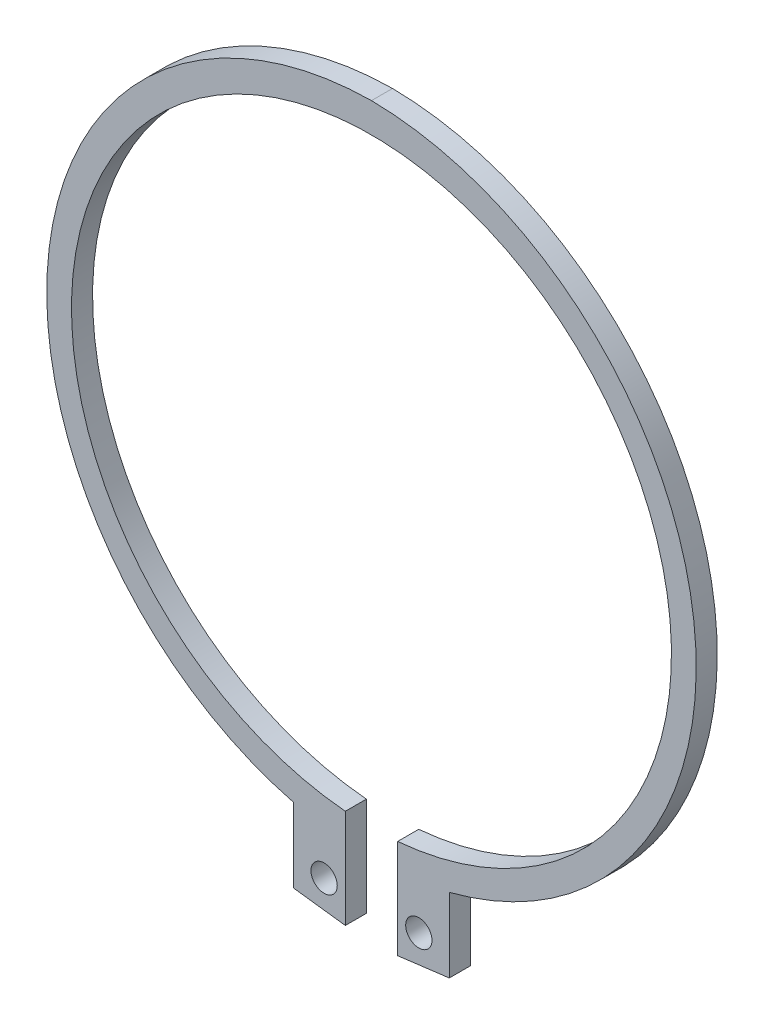
ISO-10303-21;
HEADER;
FILE_DESCRIPTION(('STEP AP214'),'2;1');
FILE_NAME('part.step','',(''),(''),'','','');
FILE_SCHEMA(('AUTOMOTIVE_DESIGN { 1 0 10303 214 1 1 1 1 }'));
ENDSEC;
DATA;
#1=APPLICATION_CONTEXT('core data for automotive mechanical design processes');
#2=APPLICATION_PROTOCOL_DEFINITION('international standard','automotive_design',2000,#1);
#3=PRODUCT_CONTEXT('',#1,'mechanical');
#4=PRODUCT('Part','Part','',(#3));
#5=PRODUCT_RELATED_PRODUCT_CATEGORY('part','',(#4));
#6=PRODUCT_DEFINITION_FORMATION('','',#4);
#7=PRODUCT_DEFINITION_CONTEXT('part definition',#1,'design');
#8=PRODUCT_DEFINITION('design','',#6,#7);
#9=PRODUCT_DEFINITION_SHAPE('','',#8);
#10=(LENGTH_UNIT() NAMED_UNIT(*) SI_UNIT(.MILLI.,.METRE.));
#11=(NAMED_UNIT(*) PLANE_ANGLE_UNIT() SI_UNIT($,.RADIAN.));
#12=(NAMED_UNIT(*) SI_UNIT($,.STERADIAN.) SOLID_ANGLE_UNIT());
#13=UNCERTAINTY_MEASURE_WITH_UNIT(LENGTH_MEASURE(1.E-05),#10,'distance_accuracy_value','');
#14=(GEOMETRIC_REPRESENTATION_CONTEXT(3) GLOBAL_UNCERTAINTY_ASSIGNED_CONTEXT((#13)) GLOBAL_UNIT_ASSIGNED_CONTEXT((#10,
#11,#12)) REPRESENTATION_CONTEXT('',''));
#15=CARTESIAN_POINT('',(0.,0.,0.));
#16=DIRECTION('',(0.,0.,1.));
#17=DIRECTION('',(1.,0.,0.));
#18=AXIS2_PLACEMENT_3D('',#15,#16,#17);
#19=CARTESIAN_POINT('',(4.5,-34.9,1.));
#20=DIRECTION('',(0.,0.,-1.));
#21=DIRECTION('',(1.,0.,0.));
#22=AXIS2_PLACEMENT_3D('',#19,#20,#21);
#23=CYLINDRICAL_SURFACE('',#22,1.25);
#24=CARTESIAN_POINT('',(4.5,-34.9,0.));
#25=DIRECTION('',(0.,0.,1.));
#26=DIRECTION('',(1.,0.,0.));
#27=AXIS2_PLACEMENT_3D('',#24,#25,#26);
#28=CIRCLE('',#27,1.25);
#29=CARTESIAN_POINT('',(5.75,-34.9,0.));
#30=VERTEX_POINT('',#29);
#31=EDGE_CURVE('E32',#30,#30,#28,.T.);
#32=ORIENTED_EDGE('',*,*,#31,.F.);
#33=EDGE_LOOP('',(#32));
#34=FACE_BOUND('',#33,.T.);
#35=CARTESIAN_POINT('',(4.5,-34.9,2.));
#36=DIRECTION('',(0.,0.,-1.));
#37=DIRECTION('',(1.,0.,0.));
#38=AXIS2_PLACEMENT_3D('',#35,#36,#37);
#39=CIRCLE('',#38,1.25);
#40=CARTESIAN_POINT('',(5.75,-34.9,2.));
#41=VERTEX_POINT('',#40);
#42=EDGE_CURVE('E155',#41,#41,#39,.T.);
#43=ORIENTED_EDGE('',*,*,#42,.F.);
#44=EDGE_LOOP('',(#43));
#45=FACE_BOUND('',#44,.T.);
#46=ADVANCED_FACE('F15',(#34,#45),#23,.F.);
#47=CARTESIAN_POINT('',(-4.5,-34.9,1.));
#48=DIRECTION('',(0.,0.,-1.));
#49=DIRECTION('',(1.,0.,0.));
#50=AXIS2_PLACEMENT_3D('',#47,#48,#49);
#51=CYLINDRICAL_SURFACE('',#50,1.25);
#52=CARTESIAN_POINT('',(-4.5,-34.9,0.));
#53=DIRECTION('',(0.,0.,1.));
#54=DIRECTION('',(1.,0.,0.));
#55=AXIS2_PLACEMENT_3D('',#52,#53,#54);
#56=CIRCLE('',#55,1.25);
#57=CARTESIAN_POINT('',(-3.25,-34.9,0.));
#58=VERTEX_POINT('',#57);
#59=EDGE_CURVE('E147',#58,#58,#56,.T.);
#60=ORIENTED_EDGE('',*,*,#59,.F.);
#61=EDGE_LOOP('',(#60));
#62=FACE_BOUND('',#61,.T.);
#63=CARTESIAN_POINT('',(-4.5,-34.9,2.));
#64=DIRECTION('',(0.,0.,-1.));
#65=DIRECTION('',(1.,0.,0.));
#66=AXIS2_PLACEMENT_3D('',#63,#64,#65);
#67=CIRCLE('',#66,1.25);
#68=CARTESIAN_POINT('',(-3.25,-34.9,2.));
#69=VERTEX_POINT('',#68);
#70=EDGE_CURVE('E120',#69,#69,#67,.T.);
#71=ORIENTED_EDGE('',*,*,#70,.F.);
#72=EDGE_LOOP('',(#71));
#73=FACE_BOUND('',#72,.T.);
#74=ADVANCED_FACE('F199',(#62,#73),#51,.F.);
#75=CARTESIAN_POINT('',(-0.361125357455722,0.110767328304308,2.));
#76=DIRECTION('',(0.,0.,1.));
#77=DIRECTION('',(-1.,0.,0.));
#78=AXIS2_PLACEMENT_3D('',#75,#76,#77);
#79=CYLINDRICAL_SURFACE('',#78,31.2113219117652);
#80=CARTESIAN_POINT('',(-0.361125357455722,0.110767328304308,0.));
#81=DIRECTION('',(0.,0.,1.));
#82=DIRECTION('',(-1.,0.,0.));
#83=AXIS2_PLACEMENT_3D('',#80,#81,#82);
#84=CIRCLE('',#83,31.2113219117652);
#85=CARTESIAN_POINT('',(7.39392320441126,-30.1217621272825,0.));
#86=VERTEX_POINT('',#85);
#87=CARTESIAN_POINT('',(0.,31.32,0.));
#88=VERTEX_POINT('',#87);
#89=EDGE_CURVE('E9',#86,#88,#84,.T.);
#90=ORIENTED_EDGE('',*,*,#89,.T.);
#91=DIRECTION('',(0.,0.,1.));
#92=VECTOR('',#91,1.);
#93=CARTESIAN_POINT('',(0.,31.32,0.));
#94=LINE('',#93,#92);
#95=CARTESIAN_POINT('',(0.,31.32,2.));
#96=VERTEX_POINT('',#95);
#97=EDGE_CURVE('E25',#88,#96,#94,.T.);
#98=ORIENTED_EDGE('',*,*,#97,.T.);
#99=CARTESIAN_POINT('',(-0.361125357455722,0.110767328304308,2.));
#100=DIRECTION('',(0.,0.,-1.));
#101=DIRECTION('',(-1.,0.,0.));
#102=AXIS2_PLACEMENT_3D('',#99,#100,#101);
#103=CIRCLE('',#102,31.2113219117652);
#104=CARTESIAN_POINT('',(7.39392320441126,-30.1217621272825,2.));
#105=VERTEX_POINT('',#104);
#106=EDGE_CURVE('E99',#96,#105,#103,.T.);
#107=ORIENTED_EDGE('',*,*,#106,.T.);
#108=DIRECTION('',(0.,0.,-1.));
#109=VECTOR('',#108,1.);
#110=CARTESIAN_POINT('',(7.39392320441126,-30.1217621272825,2.));
#111=LINE('',#110,#109);
#112=EDGE_CURVE('E165',#105,#86,#111,.T.);
#113=ORIENTED_EDGE('',*,*,#112,.T.);
#114=EDGE_LOOP('',(#90,#98,#107,#113));
#115=FACE_BOUND('',#114,.T.);
#116=ADVANCED_FACE('F205',(#115),#79,.T.);
#117=CARTESIAN_POINT('',(2.48393866830826,-33.0915488956148,2.));
#118=DIRECTION('',(-1.,0.,0.));
#119=DIRECTION('',(0.,1.,0.));
#120=AXIS2_PLACEMENT_3D('',#117,#118,#119);
#121=PLANE('',#120);
#122=DIRECTION('',(0.,-1.,0.));
#123=VECTOR('',#122,1.);
#124=CARTESIAN_POINT('',(2.48393866830826,-28.3915488956147,0.));
#125=LINE('',#124,#123);
#126=CARTESIAN_POINT('',(2.48393866830826,-28.3915488956147,0.));
#127=VERTEX_POINT('',#126);
#128=CARTESIAN_POINT('',(2.48393866830826,-37.7915488956148,0.));
#129=VERTEX_POINT('',#128);
#130=EDGE_CURVE('E166',#127,#129,#125,.T.);
#131=ORIENTED_EDGE('',*,*,#130,.T.);
#132=DIRECTION('',(0.,0.,-1.));
#133=VECTOR('',#132,1.);
#134=CARTESIAN_POINT('',(2.48393866830826,-37.7915488956148,2.));
#135=LINE('',#134,#133);
#136=CARTESIAN_POINT('',(2.48393866830826,-37.7915488956148,2.));
#137=VERTEX_POINT('',#136);
#138=EDGE_CURVE('E189',#137,#129,#135,.T.);
#139=ORIENTED_EDGE('',*,*,#138,.F.);
#140=DIRECTION('',(0.,-1.,0.));
#141=VECTOR('',#140,1.);
#142=CARTESIAN_POINT('',(2.48393866830826,-28.3915488956147,2.));
#143=LINE('',#142,#141);
#144=CARTESIAN_POINT('',(2.48393866830826,-28.3915488956147,2.));
#145=VERTEX_POINT('',#144);
#146=EDGE_CURVE('E121',#145,#137,#143,.T.);
#147=ORIENTED_EDGE('',*,*,#146,.F.);
#148=DIRECTION('',(0.,0.,-1.));
#149=VECTOR('',#148,1.);
#150=CARTESIAN_POINT('',(2.48393866830826,-28.3915488956147,2.));
#151=LINE('',#150,#149);
#152=EDGE_CURVE('E118',#145,#127,#151,.T.);
#153=ORIENTED_EDGE('',*,*,#152,.T.);
#154=EDGE_LOOP('',(#131,#139,#147,#153));
#155=FACE_BOUND('',#154,.T.);
#156=ADVANCED_FACE('F17',(#155),#121,.T.);
#157=CARTESIAN_POINT('',(4.93893093635976,-37.4816555114486,2.));
#158=DIRECTION('',(0.125236070426402,-0.992126971039571,0.));
#159=DIRECTION('',(-0.992126971039571,-0.125236070426402,0.));
#160=AXIS2_PLACEMENT_3D('',#157,#158,#159);
#161=PLANE('',#160);
#162=DIRECTION('',(0.992126971039571,0.125236070426402,0.));
#163=VECTOR('',#162,1.);
#164=CARTESIAN_POINT('',(7.39392320441126,-37.1717621272824,0.));
#165=LINE('',#164,#163);
#166=CARTESIAN_POINT('',(7.39392320441126,-37.1717621272824,0.));
#167=VERTEX_POINT('',#166);
#168=EDGE_CURVE('E160',#129,#167,#165,.T.);
#169=ORIENTED_EDGE('',*,*,#168,.T.);
#170=DIRECTION('',(0.,0.,-1.));
#171=VECTOR('',#170,1.);
#172=CARTESIAN_POINT('',(7.39392320441126,-37.1717621272824,2.));
#173=LINE('',#172,#171);
#174=CARTESIAN_POINT('',(7.39392320441126,-37.1717621272824,2.));
#175=VERTEX_POINT('',#174);
#176=EDGE_CURVE('E63',#175,#167,#173,.T.);
#177=ORIENTED_EDGE('',*,*,#176,.F.);
#178=DIRECTION('',(-0.992126971039571,-0.125236070426402,0.));
#179=VECTOR('',#178,1.);
#180=CARTESIAN_POINT('',(7.39392320441126,-37.1717621272824,2.));
#181=LINE('',#180,#179);
#182=EDGE_CURVE('E162',#175,#137,#181,.T.);
#183=ORIENTED_EDGE('',*,*,#182,.T.);
#184=ORIENTED_EDGE('',*,*,#138,.T.);
#185=EDGE_LOOP('',(#169,#177,#183,#184));
#186=FACE_BOUND('',#185,.T.);
#187=ADVANCED_FACE('F213',(#186),#161,.T.);
#188=CARTESIAN_POINT('',(7.39392320441126,-33.6467621272824,2.));
#189=DIRECTION('',(1.,0.,0.));
#190=DIRECTION('',(0.,-1.,0.));
#191=AXIS2_PLACEMENT_3D('',#188,#189,#190);
#192=PLANE('',#191);
#193=DIRECTION('',(0.,1.,0.));
#194=VECTOR('',#193,1.);
#195=CARTESIAN_POINT('',(7.39392320441126,-37.1717621272824,0.));
#196=LINE('',#195,#194);
#197=EDGE_CURVE('E19',#167,#86,#196,.T.);
#198=ORIENTED_EDGE('',*,*,#197,.T.);
#199=ORIENTED_EDGE('',*,*,#112,.F.);
#200=DIRECTION('',(0.,1.,0.));
#201=VECTOR('',#200,1.);
#202=CARTESIAN_POINT('',(7.39392320441126,-37.1717621272824,2.));
#203=LINE('',#202,#201);
#204=EDGE_CURVE('E146',#175,#105,#203,.T.);
#205=ORIENTED_EDGE('',*,*,#204,.F.);
#206=ORIENTED_EDGE('',*,*,#176,.T.);
#207=EDGE_LOOP('',(#198,#199,#205,#206));
#208=FACE_BOUND('',#207,.T.);
#209=ADVANCED_FACE('F211',(#208),#192,.T.);
#210=CARTESIAN_POINT('',(0.361125357455722,0.110767328304308,0.));
#211=DIRECTION('',(0.,0.,-1.));
#212=DIRECTION('',(1.,0.,0.));
#213=AXIS2_PLACEMENT_3D('',#210,#211,#212);
#214=CYLINDRICAL_SURFACE('',#213,31.2113219117652);
#215=CARTESIAN_POINT('',(0.361125357455722,0.110767328304308,2.));
#216=DIRECTION('',(0.,0.,-1.));
#217=DIRECTION('',(1.,0.,0.));
#218=AXIS2_PLACEMENT_3D('',#215,#216,#217);
#219=CIRCLE('',#218,31.2113219117652);
#220=CARTESIAN_POINT('',(-7.39392320441126,-30.1217621272825,2.));
#221=VERTEX_POINT('',#220);
#222=EDGE_CURVE('E143',#221,#96,#219,.T.);
#223=ORIENTED_EDGE('',*,*,#222,.T.);
#224=ORIENTED_EDGE('',*,*,#97,.F.);
#225=CARTESIAN_POINT('',(0.361125357455722,0.110767328304308,0.));
#226=DIRECTION('',(0.,0.,1.));
#227=DIRECTION('',(1.,0.,0.));
#228=AXIS2_PLACEMENT_3D('',#225,#226,#227);
#229=CIRCLE('',#228,31.2113219117652);
#230=CARTESIAN_POINT('',(-7.39392320441126,-30.1217621272825,0.));
#231=VERTEX_POINT('',#230);
#232=EDGE_CURVE('E145',#88,#231,#229,.T.);
#233=ORIENTED_EDGE('',*,*,#232,.T.);
#234=DIRECTION('',(0.,0.,1.));
#235=VECTOR('',#234,1.);
#236=CARTESIAN_POINT('',(-7.39392320441126,-30.1217621272825,0.));
#237=LINE('',#236,#235);
#238=EDGE_CURVE('E72',#231,#221,#237,.T.);
#239=ORIENTED_EDGE('',*,*,#238,.T.);
#240=EDGE_LOOP('',(#223,#224,#233,#239));
#241=FACE_BOUND('',#240,.T.);
#242=ADVANCED_FACE('F181',(#241),#214,.T.);
#243=CARTESIAN_POINT('',(0.,0.,0.));
#244=DIRECTION('',(0.,0.,-1.));
#245=DIRECTION('',(1.,0.,0.));
#246=AXIS2_PLACEMENT_3D('',#243,#244,#245);
#247=CYLINDRICAL_SURFACE('',#246,28.5);
#248=CARTESIAN_POINT('',(0.,0.,2.));
#249=DIRECTION('',(0.,0.,-1.));
#250=DIRECTION('',(-1.,0.,0.));
#251=AXIS2_PLACEMENT_3D('',#248,#249,#250);
#252=CIRCLE('',#251,28.5);
#253=CARTESIAN_POINT('',(-2.48393866830826,-28.3915488956147,2.));
#254=VERTEX_POINT('',#253);
#255=EDGE_CURVE('E116',#254,#145,#252,.T.);
#256=ORIENTED_EDGE('',*,*,#255,.F.);
#257=DIRECTION('',(0.,0.,1.));
#258=VECTOR('',#257,1.);
#259=CARTESIAN_POINT('',(-2.48393866830826,-28.3915488956147,0.));
#260=LINE('',#259,#258);
#261=CARTESIAN_POINT('',(-2.48393866830826,-28.3915488956147,0.));
#262=VERTEX_POINT('',#261);
#263=EDGE_CURVE('E111',#262,#254,#260,.T.);
#264=ORIENTED_EDGE('',*,*,#263,.F.);
#265=CARTESIAN_POINT('',(0.,0.,0.));
#266=DIRECTION('',(0.,0.,-1.));
#267=DIRECTION('',(-1.,0.,0.));
#268=AXIS2_PLACEMENT_3D('',#265,#266,#267);
#269=CIRCLE('',#268,28.5);
#270=EDGE_CURVE('E136',#262,#127,#269,.T.);
#271=ORIENTED_EDGE('',*,*,#270,.T.);
#272=ORIENTED_EDGE('',*,*,#152,.F.);
#273=EDGE_LOOP('',(#256,#264,#271,#272));
#274=FACE_BOUND('',#273,.T.);
#275=ADVANCED_FACE('F117',(#274),#247,.F.);
#276=CARTESIAN_POINT('',(-2.48393866830826,-33.0915488956148,0.));
#277=DIRECTION('',(1.,0.,0.));
#278=DIRECTION('',(0.,1.,0.));
#279=AXIS2_PLACEMENT_3D('',#276,#277,#278);
#280=PLANE('',#279);
#281=DIRECTION('',(0.,-1.,0.));
#282=VECTOR('',#281,1.);
#283=CARTESIAN_POINT('',(-2.48393866830826,-28.3915488956147,2.));
#284=LINE('',#283,#282);
#285=CARTESIAN_POINT('',(-2.48393866830826,-37.7915488956148,2.));
#286=VERTEX_POINT('',#285);
#287=EDGE_CURVE('E128',#254,#286,#284,.T.);
#288=ORIENTED_EDGE('',*,*,#287,.T.);
#289=DIRECTION('',(0.,0.,1.));
#290=VECTOR('',#289,1.);
#291=CARTESIAN_POINT('',(-2.48393866830826,-37.7915488956148,0.));
#292=LINE('',#291,#290);
#293=CARTESIAN_POINT('',(-2.48393866830826,-37.7915488956148,0.));
#294=VERTEX_POINT('',#293);
#295=EDGE_CURVE('E156',#294,#286,#292,.T.);
#296=ORIENTED_EDGE('',*,*,#295,.F.);
#297=DIRECTION('',(0.,-1.,0.));
#298=VECTOR('',#297,1.);
#299=CARTESIAN_POINT('',(-2.48393866830826,-28.3915488956147,0.));
#300=LINE('',#299,#298);
#301=EDGE_CURVE('E130',#262,#294,#300,.T.);
#302=ORIENTED_EDGE('',*,*,#301,.F.);
#303=ORIENTED_EDGE('',*,*,#263,.T.);
#304=EDGE_LOOP('',(#288,#296,#302,#303));
#305=FACE_BOUND('',#304,.T.);
#306=ADVANCED_FACE('F126',(#305),#280,.T.);
#307=CARTESIAN_POINT('',(-4.93893093635976,-37.4816555114486,0.));
#308=DIRECTION('',(-0.125236070426402,-0.992126971039571,0.));
#309=DIRECTION('',(0.992126971039571,-0.125236070426402,0.));
#310=AXIS2_PLACEMENT_3D('',#307,#308,#309);
#311=PLANE('',#310);
#312=DIRECTION('',(-0.992126971039571,0.125236070426402,0.));
#313=VECTOR('',#312,1.);
#314=CARTESIAN_POINT('',(-7.39392320441126,-37.1717621272824,2.));
#315=LINE('',#314,#313);
#316=CARTESIAN_POINT('',(-7.39392320441126,-37.1717621272824,2.));
#317=VERTEX_POINT('',#316);
#318=EDGE_CURVE('E131',#286,#317,#315,.T.);
#319=ORIENTED_EDGE('',*,*,#318,.T.);
#320=DIRECTION('',(0.,0.,1.));
#321=VECTOR('',#320,1.);
#322=CARTESIAN_POINT('',(-7.39392320441126,-37.1717621272824,0.));
#323=LINE('',#322,#321);
#324=CARTESIAN_POINT('',(-7.39392320441126,-37.1717621272824,0.));
#325=VERTEX_POINT('',#324);
#326=EDGE_CURVE('E152',#325,#317,#323,.T.);
#327=ORIENTED_EDGE('',*,*,#326,.F.);
#328=DIRECTION('',(0.992126971039571,-0.125236070426402,0.));
#329=VECTOR('',#328,1.);
#330=CARTESIAN_POINT('',(-7.39392320441126,-37.1717621272824,0.));
#331=LINE('',#330,#329);
#332=EDGE_CURVE('E141',#325,#294,#331,.T.);
#333=ORIENTED_EDGE('',*,*,#332,.T.);
#334=ORIENTED_EDGE('',*,*,#295,.T.);
#335=EDGE_LOOP('',(#319,#327,#333,#334));
#336=FACE_BOUND('',#335,.T.);
#337=ADVANCED_FACE('F223',(#336),#311,.T.);
#338=CARTESIAN_POINT('',(-7.39392320441126,-33.6467621272824,0.));
#339=DIRECTION('',(-1.,0.,0.));
#340=DIRECTION('',(0.,-1.,0.));
#341=AXIS2_PLACEMENT_3D('',#338,#339,#340);
#342=PLANE('',#341);
#343=DIRECTION('',(0.,1.,0.));
#344=VECTOR('',#343,1.);
#345=CARTESIAN_POINT('',(-7.39392320441126,-37.1717621272824,2.));
#346=LINE('',#345,#344);
#347=EDGE_CURVE('E154',#317,#221,#346,.T.);
#348=ORIENTED_EDGE('',*,*,#347,.T.);
#349=ORIENTED_EDGE('',*,*,#238,.F.);
#350=DIRECTION('',(0.,1.,0.));
#351=VECTOR('',#350,1.);
#352=CARTESIAN_POINT('',(-7.39392320441126,-37.1717621272824,0.));
#353=LINE('',#352,#351);
#354=EDGE_CURVE('E151',#325,#231,#353,.T.);
#355=ORIENTED_EDGE('',*,*,#354,.F.);
#356=ORIENTED_EDGE('',*,*,#326,.T.);
#357=EDGE_LOOP('',(#348,#349,#355,#356));
#358=FACE_BOUND('',#357,.T.);
#359=ADVANCED_FACE('F216',(#358),#342,.T.);
#360=CARTESIAN_POINT('',(-16.4291393051218,-1.80411878078535,2.));
#361=DIRECTION('',(0.,0.,1.));
#362=DIRECTION('',(1.,0.,0.));
#363=AXIS2_PLACEMENT_3D('',#360,#361,#362);
#364=PLANE('',#363);
#365=ORIENTED_EDGE('',*,*,#42,.T.);
#366=EDGE_LOOP('',(#365));
#367=FACE_BOUND('',#366,.T.);
#368=ORIENTED_EDGE('',*,*,#70,.T.);
#369=EDGE_LOOP('',(#368));
#370=FACE_BOUND('',#369,.T.);
#371=ORIENTED_EDGE('',*,*,#222,.F.);
#372=ORIENTED_EDGE('',*,*,#347,.F.);
#373=ORIENTED_EDGE('',*,*,#318,.F.);
#374=ORIENTED_EDGE('',*,*,#287,.F.);
#375=ORIENTED_EDGE('',*,*,#255,.T.);
#376=ORIENTED_EDGE('',*,*,#146,.T.);
#377=ORIENTED_EDGE('',*,*,#182,.F.);
#378=ORIENTED_EDGE('',*,*,#204,.T.);
#379=ORIENTED_EDGE('',*,*,#106,.F.);
#380=EDGE_LOOP('',(#371,#372,#373,#374,#375,#376,#377,#378,#379));
#381=FACE_BOUND('',#380,.T.);
#382=ADVANCED_FACE('F133',(#367,#370,#381),#364,.T.);
#383=CARTESIAN_POINT('',(-16.4291393051218,-1.80411878078535,0.));
#384=DIRECTION('',(0.,0.,1.));
#385=DIRECTION('',(1.,0.,0.));
#386=AXIS2_PLACEMENT_3D('',#383,#384,#385);
#387=PLANE('',#386);
#388=ORIENTED_EDGE('',*,*,#31,.T.);
#389=EDGE_LOOP('',(#388));
#390=FACE_BOUND('',#389,.T.);
#391=ORIENTED_EDGE('',*,*,#59,.T.);
#392=EDGE_LOOP('',(#391));
#393=FACE_BOUND('',#392,.T.);
#394=ORIENTED_EDGE('',*,*,#354,.T.);
#395=ORIENTED_EDGE('',*,*,#232,.F.);
#396=ORIENTED_EDGE('',*,*,#89,.F.);
#397=ORIENTED_EDGE('',*,*,#197,.F.);
#398=ORIENTED_EDGE('',*,*,#168,.F.);
#399=ORIENTED_EDGE('',*,*,#130,.F.);
#400=ORIENTED_EDGE('',*,*,#270,.F.);
#401=ORIENTED_EDGE('',*,*,#301,.T.);
#402=ORIENTED_EDGE('',*,*,#332,.F.);
#403=EDGE_LOOP('',(#394,#395,#396,#397,#398,#399,#400,#401,#402));
#404=FACE_BOUND('',#403,.T.);
#405=ADVANCED_FACE('F184',(#390,#393,#404),#387,.F.);
#406=CLOSED_SHELL('',(#46,#74,#116,#156,#187,#209,#242,#275,#306,#337,#359,#382,#405));
#407=MANIFOLD_SOLID_BREP('B1',#406);
#408=ADVANCED_BREP_SHAPE_REPRESENTATION('',(#18,#407),#14);
#409=SHAPE_DEFINITION_REPRESENTATION(#9,#408);
ENDSEC;
END-ISO-10303-21;
